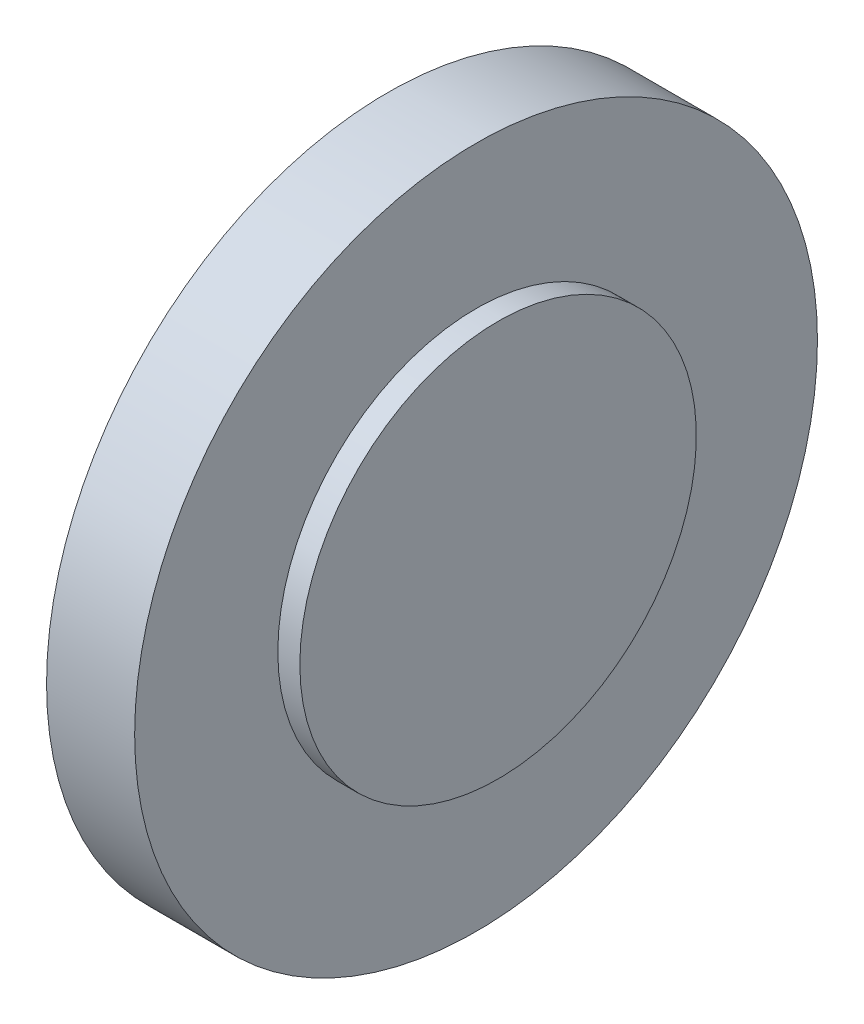
ISO-10303-21;
HEADER;
FILE_DESCRIPTION(('STEP AP214'),'2;1');
FILE_NAME('part.step','',(''),(''),'','','');
FILE_SCHEMA(('AUTOMOTIVE_DESIGN { 1 0 10303 214 1 1 1 1 }'));
ENDSEC;
DATA;
#1=APPLICATION_CONTEXT('core data for automotive mechanical design processes');
#2=APPLICATION_PROTOCOL_DEFINITION('international standard','automotive_design',2000,#1);
#3=PRODUCT_CONTEXT('',#1,'mechanical');
#4=PRODUCT('Part','Part','',(#3));
#5=PRODUCT_RELATED_PRODUCT_CATEGORY('part','',(#4));
#6=PRODUCT_DEFINITION_FORMATION('','',#4);
#7=PRODUCT_DEFINITION_CONTEXT('part definition',#1,'design');
#8=PRODUCT_DEFINITION('design','',#6,#7);
#9=PRODUCT_DEFINITION_SHAPE('','',#8);
#10=(LENGTH_UNIT() NAMED_UNIT(*) SI_UNIT(.MILLI.,.METRE.));
#11=(NAMED_UNIT(*) PLANE_ANGLE_UNIT() SI_UNIT($,.RADIAN.));
#12=(NAMED_UNIT(*) SI_UNIT($,.STERADIAN.) SOLID_ANGLE_UNIT());
#13=UNCERTAINTY_MEASURE_WITH_UNIT(LENGTH_MEASURE(1.E-05),#10,'distance_accuracy_value','');
#14=(GEOMETRIC_REPRESENTATION_CONTEXT(3) GLOBAL_UNCERTAINTY_ASSIGNED_CONTEXT((#13)) GLOBAL_UNIT_ASSIGNED_CONTEXT((#10,
#11,#12)) REPRESENTATION_CONTEXT('',''));
#15=CARTESIAN_POINT('',(0.,0.,0.));
#16=DIRECTION('',(0.,0.,1.));
#17=DIRECTION('',(1.,0.,0.));
#18=AXIS2_PLACEMENT_3D('',#15,#16,#17);
#19=CARTESIAN_POINT('',(0.,0.,0.));
#20=DIRECTION('',(1.,0.,0.));
#21=DIRECTION('',(0.,0.,-1.));
#22=AXIS2_PLACEMENT_3D('',#19,#20,#21);
#23=PLANE('',#22);
#24=CARTESIAN_POINT('',(0.,0.,0.));
#25=DIRECTION('',(-1.,0.,0.));
#26=DIRECTION('',(0.,0.,1.));
#27=AXIS2_PLACEMENT_3D('',#24,#25,#26);
#28=CIRCLE('',#27,46.5);
#29=CARTESIAN_POINT('',(0.,0.,46.5));
#30=VERTEX_POINT('',#29);
#31=EDGE_CURVE('E10',#30,#30,#28,.T.);
#32=ORIENTED_EDGE('',*,*,#31,.T.);
#33=EDGE_LOOP('',(#32));
#34=FACE_BOUND('',#33,.T.);
#35=ADVANCED_FACE('F37',(#34),#23,.F.);
#36=CARTESIAN_POINT('',(0.,0.,0.));
#37=DIRECTION('',(-1.,0.,0.));
#38=DIRECTION('',(0.,0.,1.));
#39=AXIS2_PLACEMENT_3D('',#36,#37,#38);
#40=CYLINDRICAL_SURFACE('',#39,46.5);
#41=ORIENTED_EDGE('',*,*,#31,.F.);
#42=EDGE_LOOP('',(#41));
#43=FACE_BOUND('',#42,.T.);
#44=CARTESIAN_POINT('',(12.,0.,0.));
#45=DIRECTION('',(-1.,0.,0.));
#46=DIRECTION('',(0.,0.,1.));
#47=AXIS2_PLACEMENT_3D('',#44,#45,#46);
#48=CIRCLE('',#47,46.5);
#49=CARTESIAN_POINT('',(12.,0.,46.5));
#50=VERTEX_POINT('',#49);
#51=EDGE_CURVE('E44',#50,#50,#48,.T.);
#52=ORIENTED_EDGE('',*,*,#51,.T.);
#53=EDGE_LOOP('',(#52));
#54=FACE_BOUND('',#53,.T.);
#55=ADVANCED_FACE('F73',(#43,#54),#40,.T.);
#56=CARTESIAN_POINT('',(12.,46.5,0.));
#57=DIRECTION('',(-1.,0.,0.));
#58=DIRECTION('',(0.,0.,1.));
#59=AXIS2_PLACEMENT_3D('',#56,#57,#58);
#60=PLANE('',#59);
#61=ORIENTED_EDGE('',*,*,#51,.F.);
#62=EDGE_LOOP('',(#61));
#63=FACE_BOUND('',#62,.T.);
#64=CARTESIAN_POINT('',(12.,0.,0.));
#65=DIRECTION('',(-1.,0.,0.));
#66=DIRECTION('',(0.,0.,1.));
#67=AXIS2_PLACEMENT_3D('',#64,#65,#66);
#68=CIRCLE('',#67,27.);
#69=CARTESIAN_POINT('',(12.,0.,27.));
#70=VERTEX_POINT('',#69);
#71=EDGE_CURVE('E49',#70,#70,#68,.T.);
#72=ORIENTED_EDGE('',*,*,#71,.T.);
#73=EDGE_LOOP('',(#72));
#74=FACE_BOUND('',#73,.T.);
#75=ADVANCED_FACE('F69',(#63,#74),#60,.F.);
#76=CARTESIAN_POINT('',(0.,0.,0.));
#77=DIRECTION('',(-1.,0.,0.));
#78=DIRECTION('',(0.,0.,1.));
#79=AXIS2_PLACEMENT_3D('',#76,#77,#78);
#80=CYLINDRICAL_SURFACE('',#79,27.);
#81=ORIENTED_EDGE('',*,*,#71,.F.);
#82=EDGE_LOOP('',(#81));
#83=FACE_BOUND('',#82,.T.);
#84=CARTESIAN_POINT('',(15.,0.,0.));
#85=DIRECTION('',(-1.,0.,0.));
#86=DIRECTION('',(0.,0.,1.));
#87=AXIS2_PLACEMENT_3D('',#84,#85,#86);
#88=CIRCLE('',#87,27.);
#89=CARTESIAN_POINT('',(15.,0.,27.));
#90=VERTEX_POINT('',#89);
#91=EDGE_CURVE('E54',#90,#90,#88,.T.);
#92=ORIENTED_EDGE('',*,*,#91,.T.);
#93=EDGE_LOOP('',(#92));
#94=FACE_BOUND('',#93,.T.);
#95=ADVANCED_FACE('F61',(#83,#94),#80,.T.);
#96=CARTESIAN_POINT('',(15.,27.,0.));
#97=DIRECTION('',(-1.,0.,0.));
#98=DIRECTION('',(0.,0.,1.));
#99=AXIS2_PLACEMENT_3D('',#96,#97,#98);
#100=PLANE('',#99);
#101=ORIENTED_EDGE('',*,*,#91,.F.);
#102=EDGE_LOOP('',(#101));
#103=FACE_BOUND('',#102,.T.);
#104=ADVANCED_FACE('F63',(#103),#100,.F.);
#105=CLOSED_SHELL('',(#35,#55,#75,#95,#104));
#106=MANIFOLD_SOLID_BREP('B2',#105);
#107=ADVANCED_BREP_SHAPE_REPRESENTATION('',(#18,#106),#14);
#108=SHAPE_DEFINITION_REPRESENTATION(#9,#107);
ENDSEC;
END-ISO-10303-21;
